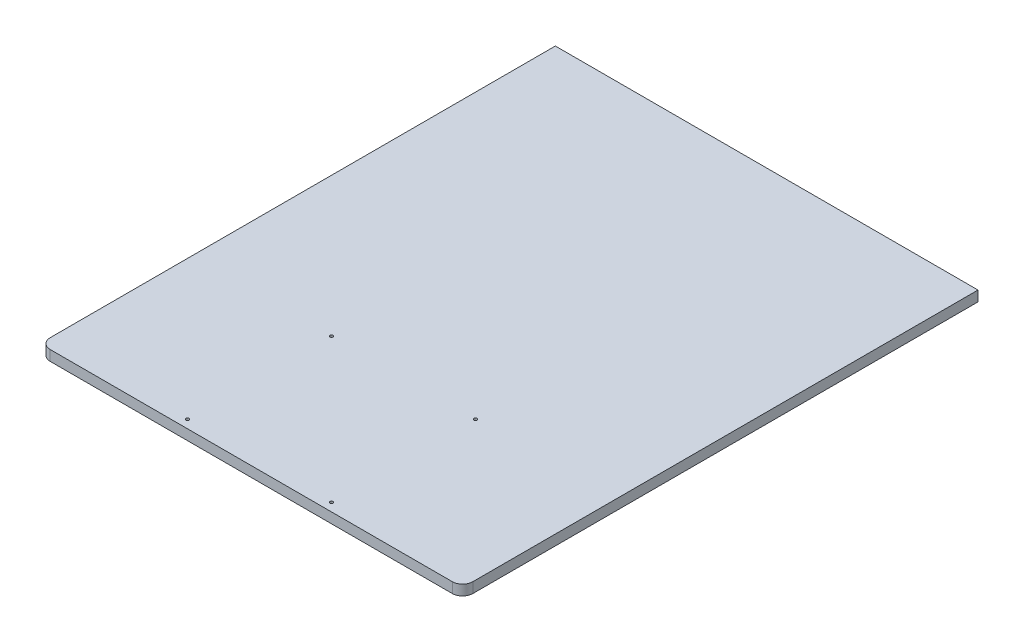
ISO-10303-21;
HEADER;
FILE_DESCRIPTION(('STEP AP214'),'2;1');
FILE_NAME('part.step','',(''),(''),'','','');
FILE_SCHEMA(('AUTOMOTIVE_DESIGN { 1 0 10303 214 1 1 1 1 }'));
ENDSEC;
DATA;
#1=APPLICATION_CONTEXT('core data for automotive mechanical design processes');
#2=APPLICATION_PROTOCOL_DEFINITION('international standard','automotive_design',2000,#1);
#3=PRODUCT_CONTEXT('',#1,'mechanical');
#4=PRODUCT('Part','Part','',(#3));
#5=PRODUCT_RELATED_PRODUCT_CATEGORY('part','',(#4));
#6=PRODUCT_DEFINITION_FORMATION('','',#4);
#7=PRODUCT_DEFINITION_CONTEXT('part definition',#1,'design');
#8=PRODUCT_DEFINITION('design','',#6,#7);
#9=PRODUCT_DEFINITION_SHAPE('','',#8);
#10=(LENGTH_UNIT() NAMED_UNIT(*) SI_UNIT(.MILLI.,.METRE.));
#11=(NAMED_UNIT(*) PLANE_ANGLE_UNIT() SI_UNIT($,.RADIAN.));
#12=(NAMED_UNIT(*) SI_UNIT($,.STERADIAN.) SOLID_ANGLE_UNIT());
#13=UNCERTAINTY_MEASURE_WITH_UNIT(LENGTH_MEASURE(1.E-05),#10,'distance_accuracy_value','');
#14=(GEOMETRIC_REPRESENTATION_CONTEXT(3) GLOBAL_UNCERTAINTY_ASSIGNED_CONTEXT((#13)) GLOBAL_UNIT_ASSIGNED_CONTEXT((#10,
#11,#12)) REPRESENTATION_CONTEXT('',''));
#15=CARTESIAN_POINT('',(0.,0.,0.));
#16=DIRECTION('',(0.,0.,1.));
#17=DIRECTION('',(1.,0.,0.));
#18=AXIS2_PLACEMENT_3D('',#15,#16,#17);
#19=CARTESIAN_POINT('',(205.,10.,0.));
#20=DIRECTION('',(1.,0.,0.));
#21=DIRECTION('',(0.,0.,-1.));
#22=AXIS2_PLACEMENT_3D('',#19,#20,#21);
#23=PLANE('',#22);
#24=DIRECTION('',(0.,0.,1.));
#25=VECTOR('',#24,1.);
#26=CARTESIAN_POINT('',(205.,10.,0.));
#27=LINE('',#26,#25);
#28=CARTESIAN_POINT('',(205.,10.,-250.));
#29=VERTEX_POINT('',#28);
#30=CARTESIAN_POINT('',(205.,10.,240.));
#31=VERTEX_POINT('',#30);
#32=EDGE_CURVE('E98',#29,#31,#27,.T.);
#33=ORIENTED_EDGE('',*,*,#32,.T.);
#34=DIRECTION('',(0.,-1.,0.));
#35=VECTOR('',#34,1.);
#36=CARTESIAN_POINT('',(205.,0.,240.));
#37=LINE('',#36,#35);
#38=CARTESIAN_POINT('',(205.,0.,240.));
#39=VERTEX_POINT('',#38);
#40=EDGE_CURVE('E11',#31,#39,#37,.T.);
#41=ORIENTED_EDGE('',*,*,#40,.T.);
#42=DIRECTION('',(0.,0.,1.));
#43=VECTOR('',#42,1.);
#44=CARTESIAN_POINT('',(205.,0.,0.));
#45=LINE('',#44,#43);
#46=CARTESIAN_POINT('',(205.,0.,-250.));
#47=VERTEX_POINT('',#46);
#48=EDGE_CURVE('E101',#47,#39,#45,.T.);
#49=ORIENTED_EDGE('',*,*,#48,.F.);
#50=DIRECTION('',(0.,-1.,0.));
#51=VECTOR('',#50,1.);
#52=CARTESIAN_POINT('',(205.,10.,-250.));
#53=LINE('',#52,#51);
#54=EDGE_CURVE('E97',#29,#47,#53,.T.);
#55=ORIENTED_EDGE('',*,*,#54,.F.);
#56=EDGE_LOOP('',(#33,#41,#49,#55));
#57=FACE_BOUND('',#56,.T.);
#58=ADVANCED_FACE('F40',(#57),#23,.T.);
#59=CARTESIAN_POINT('',(0.,10.,-250.));
#60=DIRECTION('',(0.,0.,-1.));
#61=DIRECTION('',(-1.,0.,0.));
#62=AXIS2_PLACEMENT_3D('',#59,#60,#61);
#63=PLANE('',#62);
#64=DIRECTION('',(1.,0.,0.));
#65=VECTOR('',#64,1.);
#66=CARTESIAN_POINT('',(0.,0.,-250.));
#67=LINE('',#66,#65);
#68=CARTESIAN_POINT('',(-205.,0.,-250.));
#69=VERTEX_POINT('',#68);
#70=EDGE_CURVE('E145',#69,#47,#67,.T.);
#71=ORIENTED_EDGE('',*,*,#70,.F.);
#72=DIRECTION('',(0.,-1.,0.));
#73=VECTOR('',#72,1.);
#74=CARTESIAN_POINT('',(-205.,10.,-250.));
#75=LINE('',#74,#73);
#76=CARTESIAN_POINT('',(-205.,10.,-250.));
#77=VERTEX_POINT('',#76);
#78=EDGE_CURVE('E108',#77,#69,#75,.T.);
#79=ORIENTED_EDGE('',*,*,#78,.F.);
#80=DIRECTION('',(1.,0.,0.));
#81=VECTOR('',#80,1.);
#82=CARTESIAN_POINT('',(0.,10.,-250.));
#83=LINE('',#82,#81);
#84=EDGE_CURVE('E113',#77,#29,#83,.T.);
#85=ORIENTED_EDGE('',*,*,#84,.T.);
#86=ORIENTED_EDGE('',*,*,#54,.T.);
#87=EDGE_LOOP('',(#71,#79,#85,#86));
#88=FACE_BOUND('',#87,.T.);
#89=ADVANCED_FACE('F117',(#88),#63,.T.);
#90=CARTESIAN_POINT('',(-205.,10.,0.));
#91=DIRECTION('',(1.,0.,0.));
#92=DIRECTION('',(0.,0.,-1.));
#93=AXIS2_PLACEMENT_3D('',#90,#91,#92);
#94=PLANE('',#93);
#95=DIRECTION('',(0.,0.,1.));
#96=VECTOR('',#95,1.);
#97=CARTESIAN_POINT('',(-205.,0.,0.));
#98=LINE('',#97,#96);
#99=CARTESIAN_POINT('',(-205.,0.,240.));
#100=VERTEX_POINT('',#99);
#101=EDGE_CURVE('E148',#69,#100,#98,.T.);
#102=ORIENTED_EDGE('',*,*,#101,.T.);
#103=DIRECTION('',(0.,-1.,0.));
#104=VECTOR('',#103,1.);
#105=CARTESIAN_POINT('',(-205.,10.,240.));
#106=LINE('',#105,#104);
#107=CARTESIAN_POINT('',(-205.,10.,240.));
#108=VERTEX_POINT('',#107);
#109=EDGE_CURVE('E64',#100,#108,#106,.F.);
#110=ORIENTED_EDGE('',*,*,#109,.T.);
#111=DIRECTION('',(0.,0.,1.));
#112=VECTOR('',#111,1.);
#113=CARTESIAN_POINT('',(-205.,10.,0.));
#114=LINE('',#113,#112);
#115=EDGE_CURVE('E119',#77,#108,#114,.T.);
#116=ORIENTED_EDGE('',*,*,#115,.F.);
#117=ORIENTED_EDGE('',*,*,#78,.T.);
#118=EDGE_LOOP('',(#102,#110,#116,#117));
#119=FACE_BOUND('',#118,.T.);
#120=ADVANCED_FACE('F201',(#119),#94,.F.);
#121=CARTESIAN_POINT('',(69.8514035988078,10.,102.297192802384));
#122=DIRECTION('',(0.,-1.,0.));
#123=DIRECTION('',(0.,0.,-1.));
#124=AXIS2_PLACEMENT_3D('',#121,#122,#123);
#125=CYLINDRICAL_SURFACE('',#124,1.49999999999997);
#126=CARTESIAN_POINT('',(69.8514035988078,10.,102.297192802384));
#127=DIRECTION('',(0.,1.,0.));
#128=DIRECTION('',(0.,0.,1.));
#129=AXIS2_PLACEMENT_3D('',#126,#127,#128);
#130=CIRCLE('',#129,1.49999999999997);
#131=CARTESIAN_POINT('',(69.8514035988078,10.,103.797192802384));
#132=VERTEX_POINT('',#131);
#133=EDGE_CURVE('E135',#132,#132,#130,.T.);
#134=ORIENTED_EDGE('',*,*,#133,.T.);
#135=EDGE_LOOP('',(#134));
#136=FACE_BOUND('',#135,.T.);
#137=CARTESIAN_POINT('',(69.8514035988078,0.,102.297192802384));
#138=DIRECTION('',(0.,1.,0.));
#139=DIRECTION('',(0.,0.,1.));
#140=AXIS2_PLACEMENT_3D('',#137,#138,#139);
#141=CIRCLE('',#140,1.49999999999997);
#142=CARTESIAN_POINT('',(69.8514035988078,0.,103.797192802384));
#143=VERTEX_POINT('',#142);
#144=EDGE_CURVE('E163',#143,#143,#141,.T.);
#145=ORIENTED_EDGE('',*,*,#144,.F.);
#146=EDGE_LOOP('',(#145));
#147=FACE_BOUND('',#146,.T.);
#148=ADVANCED_FACE('F203',(#136,#147),#125,.F.);
#149=CARTESIAN_POINT('',(-69.8514035988078,10.,102.297192802384));
#150=DIRECTION('',(0.,-1.,0.));
#151=DIRECTION('',(0.,0.,-1.));
#152=AXIS2_PLACEMENT_3D('',#149,#150,#151);
#153=CYLINDRICAL_SURFACE('',#152,1.49999999999997);
#154=CARTESIAN_POINT('',(-69.8514035988078,10.,102.297192802384));
#155=DIRECTION('',(0.,1.,0.));
#156=DIRECTION('',(0.,0.,1.));
#157=AXIS2_PLACEMENT_3D('',#154,#155,#156);
#158=CIRCLE('',#157,1.49999999999997);
#159=CARTESIAN_POINT('',(-69.8514035988078,10.,103.797192802384));
#160=VERTEX_POINT('',#159);
#161=EDGE_CURVE('E131',#160,#160,#158,.T.);
#162=ORIENTED_EDGE('',*,*,#161,.T.);
#163=EDGE_LOOP('',(#162));
#164=FACE_BOUND('',#163,.T.);
#165=CARTESIAN_POINT('',(-69.8514035988078,0.,102.297192802384));
#166=DIRECTION('',(0.,1.,0.));
#167=DIRECTION('',(0.,0.,1.));
#168=AXIS2_PLACEMENT_3D('',#165,#166,#167);
#169=CIRCLE('',#168,1.49999999999997);
#170=CARTESIAN_POINT('',(-69.8514035988078,0.,103.797192802384));
#171=VERTEX_POINT('',#170);
#172=EDGE_CURVE('E159',#171,#171,#169,.T.);
#173=ORIENTED_EDGE('',*,*,#172,.F.);
#174=EDGE_LOOP('',(#173));
#175=FACE_BOUND('',#174,.T.);
#176=ADVANCED_FACE('F210',(#164,#175),#153,.F.);
#177=CARTESIAN_POINT('',(-69.8514035988078,10.,242.));
#178=DIRECTION('',(0.,-1.,0.));
#179=DIRECTION('',(0.,0.,-1.));
#180=AXIS2_PLACEMENT_3D('',#177,#178,#179);
#181=CYLINDRICAL_SURFACE('',#180,1.49999999999997);
#182=CARTESIAN_POINT('',(-69.8514035988078,10.,242.));
#183=DIRECTION('',(0.,1.,0.));
#184=DIRECTION('',(0.,0.,1.));
#185=AXIS2_PLACEMENT_3D('',#182,#183,#184);
#186=CIRCLE('',#185,1.49999999999997);
#187=CARTESIAN_POINT('',(-69.8514035988078,10.,243.5));
#188=VERTEX_POINT('',#187);
#189=EDGE_CURVE('E127',#188,#188,#186,.T.);
#190=ORIENTED_EDGE('',*,*,#189,.T.);
#191=EDGE_LOOP('',(#190));
#192=FACE_BOUND('',#191,.T.);
#193=CARTESIAN_POINT('',(-69.8514035988078,0.,242.));
#194=DIRECTION('',(0.,1.,0.));
#195=DIRECTION('',(0.,0.,1.));
#196=AXIS2_PLACEMENT_3D('',#193,#194,#195);
#197=CIRCLE('',#196,1.49999999999997);
#198=CARTESIAN_POINT('',(-69.8514035988078,0.,243.5));
#199=VERTEX_POINT('',#198);
#200=EDGE_CURVE('E155',#199,#199,#197,.T.);
#201=ORIENTED_EDGE('',*,*,#200,.F.);
#202=EDGE_LOOP('',(#201));
#203=FACE_BOUND('',#202,.T.);
#204=ADVANCED_FACE('F238',(#192,#203),#181,.F.);
#205=CARTESIAN_POINT('',(0.,10.,250.));
#206=DIRECTION('',(0.,0.,-1.));
#207=DIRECTION('',(-1.,0.,0.));
#208=AXIS2_PLACEMENT_3D('',#205,#206,#207);
#209=PLANE('',#208);
#210=DIRECTION('',(1.,0.,0.));
#211=VECTOR('',#210,1.);
#212=CARTESIAN_POINT('',(0.,10.,250.));
#213=LINE('',#212,#211);
#214=CARTESIAN_POINT('',(-195.,10.,250.));
#215=VERTEX_POINT('',#214);
#216=CARTESIAN_POINT('',(195.,10.,250.));
#217=VERTEX_POINT('',#216);
#218=EDGE_CURVE('E122',#215,#217,#213,.T.);
#219=ORIENTED_EDGE('',*,*,#218,.F.);
#220=DIRECTION('',(0.,-1.,0.));
#221=VECTOR('',#220,1.);
#222=CARTESIAN_POINT('',(-195.,10.,250.));
#223=LINE('',#222,#221);
#224=CARTESIAN_POINT('',(-195.,0.,250.));
#225=VERTEX_POINT('',#224);
#226=EDGE_CURVE('E174',#215,#225,#223,.T.);
#227=ORIENTED_EDGE('',*,*,#226,.T.);
#228=DIRECTION('',(1.,0.,0.));
#229=VECTOR('',#228,1.);
#230=CARTESIAN_POINT('',(0.,0.,250.));
#231=LINE('',#230,#229);
#232=CARTESIAN_POINT('',(195.,0.,250.));
#233=VERTEX_POINT('',#232);
#234=EDGE_CURVE('E151',#225,#233,#231,.T.);
#235=ORIENTED_EDGE('',*,*,#234,.T.);
#236=DIRECTION('',(0.,-1.,0.));
#237=VECTOR('',#236,1.);
#238=CARTESIAN_POINT('',(195.,10.,250.));
#239=LINE('',#238,#237);
#240=EDGE_CURVE('E107',#233,#217,#239,.F.);
#241=ORIENTED_EDGE('',*,*,#240,.T.);
#242=EDGE_LOOP('',(#219,#227,#235,#241));
#243=FACE_BOUND('',#242,.T.);
#244=ADVANCED_FACE('F193',(#243),#209,.F.);
#245=CARTESIAN_POINT('',(69.8514035988078,10.,242.));
#246=DIRECTION('',(0.,-1.,0.));
#247=DIRECTION('',(0.,0.,-1.));
#248=AXIS2_PLACEMENT_3D('',#245,#246,#247);
#249=CYLINDRICAL_SURFACE('',#248,1.49999999999997);
#250=CARTESIAN_POINT('',(69.8514035988078,10.,242.));
#251=DIRECTION('',(0.,1.,0.));
#252=DIRECTION('',(0.,0.,1.));
#253=AXIS2_PLACEMENT_3D('',#250,#251,#252);
#254=CIRCLE('',#253,1.49999999999997);
#255=CARTESIAN_POINT('',(69.8514035988078,10.,243.5));
#256=VERTEX_POINT('',#255);
#257=EDGE_CURVE('E139',#256,#256,#254,.F.);
#258=ORIENTED_EDGE('',*,*,#257,.F.);
#259=EDGE_LOOP('',(#258));
#260=FACE_BOUND('',#259,.T.);
#261=CARTESIAN_POINT('',(69.8514035988078,0.,242.));
#262=DIRECTION('',(0.,1.,0.));
#263=DIRECTION('',(0.,0.,1.));
#264=AXIS2_PLACEMENT_3D('',#261,#262,#263);
#265=CIRCLE('',#264,1.49999999999997);
#266=CARTESIAN_POINT('',(69.8514035988078,0.,243.5));
#267=VERTEX_POINT('',#266);
#268=EDGE_CURVE('E115',#267,#267,#265,.F.);
#269=ORIENTED_EDGE('',*,*,#268,.T.);
#270=EDGE_LOOP('',(#269));
#271=FACE_BOUND('',#270,.T.);
#272=ADVANCED_FACE('F230',(#260,#271),#249,.F.);
#273=CARTESIAN_POINT('',(0.,10.,0.));
#274=DIRECTION('',(0.,1.,0.));
#275=DIRECTION('',(0.,0.,1.));
#276=AXIS2_PLACEMENT_3D('',#273,#274,#275);
#277=PLANE('',#276);
#278=ORIENTED_EDGE('',*,*,#115,.T.);
#279=CARTESIAN_POINT('',(-195.,10.,240.));
#280=DIRECTION('',(0.,1.,0.));
#281=DIRECTION('',(0.,0.,1.));
#282=AXIS2_PLACEMENT_3D('',#279,#280,#281);
#283=CIRCLE('',#282,10.);
#284=EDGE_CURVE('E49',#108,#215,#283,.T.);
#285=ORIENTED_EDGE('',*,*,#284,.T.);
#286=ORIENTED_EDGE('',*,*,#218,.T.);
#287=CARTESIAN_POINT('',(195.,10.,240.));
#288=DIRECTION('',(0.,1.,0.));
#289=DIRECTION('',(0.,0.,1.));
#290=AXIS2_PLACEMENT_3D('',#287,#288,#289);
#291=CIRCLE('',#290,10.);
#292=EDGE_CURVE('E56',#217,#31,#291,.T.);
#293=ORIENTED_EDGE('',*,*,#292,.T.);
#294=ORIENTED_EDGE('',*,*,#32,.F.);
#295=ORIENTED_EDGE('',*,*,#84,.F.);
#296=EDGE_LOOP('',(#278,#285,#286,#293,#294,#295));
#297=FACE_BOUND('',#296,.T.);
#298=ORIENTED_EDGE('',*,*,#189,.F.);
#299=EDGE_LOOP('',(#298));
#300=FACE_BOUND('',#299,.T.);
#301=ORIENTED_EDGE('',*,*,#161,.F.);
#302=EDGE_LOOP('',(#301));
#303=FACE_BOUND('',#302,.T.);
#304=ORIENTED_EDGE('',*,*,#133,.F.);
#305=EDGE_LOOP('',(#304));
#306=FACE_BOUND('',#305,.T.);
#307=ORIENTED_EDGE('',*,*,#257,.T.);
#308=EDGE_LOOP('',(#307));
#309=FACE_BOUND('',#308,.T.);
#310=ADVANCED_FACE('F111',(#297,#300,#303,#306,#309),#277,.T.);
#311=CARTESIAN_POINT('',(0.,0.,0.));
#312=DIRECTION('',(0.,1.,0.));
#313=DIRECTION('',(0.,0.,1.));
#314=AXIS2_PLACEMENT_3D('',#311,#312,#313);
#315=PLANE('',#314);
#316=ORIENTED_EDGE('',*,*,#234,.F.);
#317=CARTESIAN_POINT('',(-195.,0.,240.));
#318=DIRECTION('',(0.,1.,0.));
#319=DIRECTION('',(0.,0.,1.));
#320=AXIS2_PLACEMENT_3D('',#317,#318,#319);
#321=CIRCLE('',#320,10.);
#322=EDGE_CURVE('E181',#225,#100,#321,.F.);
#323=ORIENTED_EDGE('',*,*,#322,.T.);
#324=ORIENTED_EDGE('',*,*,#101,.F.);
#325=ORIENTED_EDGE('',*,*,#70,.T.);
#326=ORIENTED_EDGE('',*,*,#48,.T.);
#327=CARTESIAN_POINT('',(195.,0.,240.));
#328=DIRECTION('',(0.,1.,0.));
#329=DIRECTION('',(0.,0.,1.));
#330=AXIS2_PLACEMENT_3D('',#327,#328,#329);
#331=CIRCLE('',#330,10.);
#332=EDGE_CURVE('E178',#39,#233,#331,.F.);
#333=ORIENTED_EDGE('',*,*,#332,.T.);
#334=EDGE_LOOP('',(#316,#323,#324,#325,#326,#333));
#335=FACE_BOUND('',#334,.T.);
#336=ORIENTED_EDGE('',*,*,#200,.T.);
#337=EDGE_LOOP('',(#336));
#338=FACE_BOUND('',#337,.T.);
#339=ORIENTED_EDGE('',*,*,#172,.T.);
#340=EDGE_LOOP('',(#339));
#341=FACE_BOUND('',#340,.T.);
#342=ORIENTED_EDGE('',*,*,#144,.T.);
#343=EDGE_LOOP('',(#342));
#344=FACE_BOUND('',#343,.T.);
#345=ORIENTED_EDGE('',*,*,#268,.F.);
#346=EDGE_LOOP('',(#345));
#347=FACE_BOUND('',#346,.T.);
#348=ADVANCED_FACE('F199',(#335,#338,#341,#344,#347),#315,.F.);
#349=CARTESIAN_POINT('',(-195.,10.,240.));
#350=DIRECTION('',(0.,-1.,0.));
#351=DIRECTION('',(0.,0.,-1.));
#352=AXIS2_PLACEMENT_3D('',#349,#350,#351);
#353=CYLINDRICAL_SURFACE('',#352,10.);
#354=ORIENTED_EDGE('',*,*,#284,.F.);
#355=ORIENTED_EDGE('',*,*,#109,.F.);
#356=ORIENTED_EDGE('',*,*,#322,.F.);
#357=ORIENTED_EDGE('',*,*,#226,.F.);
#358=EDGE_LOOP('',(#354,#355,#356,#357));
#359=FACE_BOUND('',#358,.T.);
#360=ADVANCED_FACE('F196',(#359),#353,.T.);
#361=CARTESIAN_POINT('',(195.,10.,240.));
#362=DIRECTION('',(0.,1.,0.));
#363=DIRECTION('',(0.,0.,1.));
#364=AXIS2_PLACEMENT_3D('',#361,#362,#363);
#365=CYLINDRICAL_SURFACE('',#364,10.);
#366=ORIENTED_EDGE('',*,*,#292,.F.);
#367=ORIENTED_EDGE('',*,*,#240,.F.);
#368=ORIENTED_EDGE('',*,*,#332,.F.);
#369=ORIENTED_EDGE('',*,*,#40,.F.);
#370=EDGE_LOOP('',(#366,#367,#368,#369));
#371=FACE_BOUND('',#370,.T.);
#372=ADVANCED_FACE('F42',(#371),#365,.T.);
#373=CLOSED_SHELL('',(#58,#89,#120,#148,#176,#204,#244,#272,#310,#348,#360,#372));
#374=MANIFOLD_SOLID_BREP('B2',#373);
#375=ADVANCED_BREP_SHAPE_REPRESENTATION('',(#18,#374),#14);
#376=SHAPE_DEFINITION_REPRESENTATION(#9,#375);
ENDSEC;
END-ISO-10303-21;
